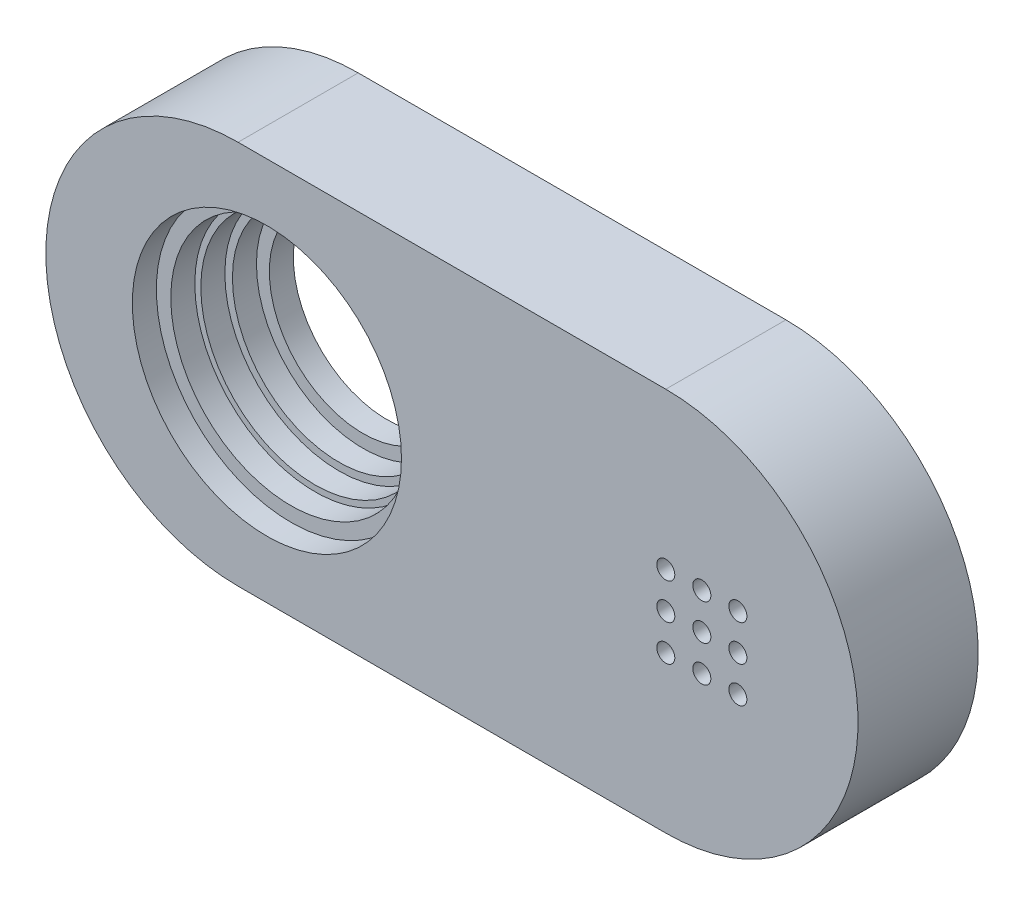
ISO-10303-21;
HEADER;
FILE_DESCRIPTION(('STEP AP214'),'2;1');
FILE_NAME('part.step','',(''),(''),'','','');
FILE_SCHEMA(('AUTOMOTIVE_DESIGN { 1 0 10303 214 1 1 1 1 }'));
ENDSEC;
DATA;
#1=APPLICATION_CONTEXT('core data for automotive mechanical design processes');
#2=APPLICATION_PROTOCOL_DEFINITION('international standard','automotive_design',2000,#1);
#3=PRODUCT_CONTEXT('',#1,'mechanical');
#4=PRODUCT('Part','Part','',(#3));
#5=PRODUCT_RELATED_PRODUCT_CATEGORY('part','',(#4));
#6=PRODUCT_DEFINITION_FORMATION('','',#4);
#7=PRODUCT_DEFINITION_CONTEXT('part definition',#1,'design');
#8=PRODUCT_DEFINITION('design','',#6,#7);
#9=PRODUCT_DEFINITION_SHAPE('','',#8);
#10=(LENGTH_UNIT() NAMED_UNIT(*) SI_UNIT(.MILLI.,.METRE.));
#11=(NAMED_UNIT(*) PLANE_ANGLE_UNIT() SI_UNIT($,.RADIAN.));
#12=(NAMED_UNIT(*) SI_UNIT($,.STERADIAN.) SOLID_ANGLE_UNIT());
#13=UNCERTAINTY_MEASURE_WITH_UNIT(LENGTH_MEASURE(1.E-05),#10,'distance_accuracy_value','');
#14=(GEOMETRIC_REPRESENTATION_CONTEXT(3) GLOBAL_UNCERTAINTY_ASSIGNED_CONTEXT((#13)) GLOBAL_UNIT_ASSIGNED_CONTEXT((#10,
#11,#12)) REPRESENTATION_CONTEXT('',''));
#15=CARTESIAN_POINT('',(0.,0.,0.));
#16=DIRECTION('',(0.,0.,1.));
#17=DIRECTION('',(1.,0.,0.));
#18=AXIS2_PLACEMENT_3D('',#15,#16,#17);
#19=CARTESIAN_POINT('',(-7.7,0.,3.));
#20=DIRECTION('',(0.,0.,1.));
#21=DIRECTION('',(1.,0.,0.));
#22=AXIS2_PLACEMENT_3D('',#19,#20,#21);
#23=PLANE('',#22);
#24=CARTESIAN_POINT('',(-7.7,0.,3.));
#25=DIRECTION('',(0.,0.,1.));
#26=DIRECTION('',(1.,0.,0.));
#27=AXIS2_PLACEMENT_3D('',#24,#25,#26);
#28=CIRCLE('',#27,4.75);
#29=CARTESIAN_POINT('',(-2.95,0.,3.));
#30=VERTEX_POINT('',#29);
#31=EDGE_CURVE('E20',#30,#30,#28,.F.);
#32=ORIENTED_EDGE('',*,*,#31,.T.);
#33=EDGE_LOOP('',(#32));
#34=FACE_BOUND('',#33,.T.);
#35=CARTESIAN_POINT('',(-7.7,0.,3.));
#36=DIRECTION('',(0.,0.,1.));
#37=DIRECTION('',(1.,0.,0.));
#38=AXIS2_PLACEMENT_3D('',#35,#36,#37);
#39=CIRCLE('',#38,5.);
#40=CARTESIAN_POINT('',(-2.7,0.,3.));
#41=VERTEX_POINT('',#40);
#42=EDGE_CURVE('E168',#41,#41,#39,.T.);
#43=ORIENTED_EDGE('',*,*,#42,.T.);
#44=EDGE_LOOP('',(#43));
#45=FACE_BOUND('',#44,.T.);
#46=ADVANCED_FACE('F17',(#34,#45),#23,.T.);
#47=CARTESIAN_POINT('',(-7.7,0.,2.));
#48=DIRECTION('',(0.,0.,1.));
#49=DIRECTION('',(1.,0.,0.));
#50=AXIS2_PLACEMENT_3D('',#47,#48,#49);
#51=CYLINDRICAL_SURFACE('',#50,4.75);
#52=ORIENTED_EDGE('',*,*,#31,.F.);
#53=EDGE_LOOP('',(#52));
#54=FACE_BOUND('',#53,.T.);
#55=CARTESIAN_POINT('',(-7.7,0.,2.));
#56=DIRECTION('',(0.,0.,1.));
#57=DIRECTION('',(1.,0.,0.));
#58=AXIS2_PLACEMENT_3D('',#55,#56,#57);
#59=CIRCLE('',#58,4.75);
#60=CARTESIAN_POINT('',(-2.95,0.,2.));
#61=VERTEX_POINT('',#60);
#62=EDGE_CURVE('E166',#61,#61,#59,.T.);
#63=ORIENTED_EDGE('',*,*,#62,.F.);
#64=EDGE_LOOP('',(#63));
#65=FACE_BOUND('',#64,.T.);
#66=ADVANCED_FACE('F176',(#54,#65),#51,.F.);
#67=CARTESIAN_POINT('',(-7.7,0.,3.));
#68=DIRECTION('',(0.,0.,1.));
#69=DIRECTION('',(1.,0.,0.));
#70=AXIS2_PLACEMENT_3D('',#67,#68,#69);
#71=CYLINDRICAL_SURFACE('',#70,5.);
#72=ORIENTED_EDGE('',*,*,#42,.F.);
#73=EDGE_LOOP('',(#72));
#74=FACE_BOUND('',#73,.T.);
#75=CARTESIAN_POINT('',(-7.7,0.,4.));
#76=DIRECTION('',(0.,0.,1.));
#77=DIRECTION('',(1.,0.,0.));
#78=AXIS2_PLACEMENT_3D('',#75,#76,#77);
#79=CIRCLE('',#78,5.);
#80=CARTESIAN_POINT('',(-2.7,0.,4.));
#81=VERTEX_POINT('',#80);
#82=EDGE_CURVE('E163',#81,#81,#79,.F.);
#83=ORIENTED_EDGE('',*,*,#82,.F.);
#84=EDGE_LOOP('',(#83));
#85=FACE_BOUND('',#84,.T.);
#86=ADVANCED_FACE('F179',(#74,#85),#71,.F.);
#87=CARTESIAN_POINT('',(-7.7,0.,2.));
#88=DIRECTION('',(0.,0.,1.));
#89=DIRECTION('',(1.,0.,0.));
#90=AXIS2_PLACEMENT_3D('',#87,#88,#89);
#91=PLANE('',#90);
#92=CARTESIAN_POINT('',(-7.7,0.,2.));
#93=DIRECTION('',(0.,0.,1.));
#94=DIRECTION('',(1.,0.,0.));
#95=AXIS2_PLACEMENT_3D('',#92,#93,#94);
#96=CIRCLE('',#95,4.435);
#97=CARTESIAN_POINT('',(-3.265,0.,2.));
#98=VERTEX_POINT('',#97);
#99=EDGE_CURVE('E160',#98,#98,#96,.F.);
#100=ORIENTED_EDGE('',*,*,#99,.T.);
#101=EDGE_LOOP('',(#100));
#102=FACE_BOUND('',#101,.T.);
#103=ORIENTED_EDGE('',*,*,#62,.T.);
#104=EDGE_LOOP('',(#103));
#105=FACE_BOUND('',#104,.T.);
#106=ADVANCED_FACE('F182',(#102,#105),#91,.T.);
#107=CARTESIAN_POINT('',(-7.7,0.,4.));
#108=DIRECTION('',(0.,0.,1.));
#109=DIRECTION('',(1.,0.,0.));
#110=AXIS2_PLACEMENT_3D('',#107,#108,#109);
#111=PLANE('',#110);
#112=ORIENTED_EDGE('',*,*,#82,.T.);
#113=EDGE_LOOP('',(#112));
#114=FACE_BOUND('',#113,.T.);
#115=CARTESIAN_POINT('',(-7.7,0.,4.));
#116=DIRECTION('',(0.,0.,1.));
#117=DIRECTION('',(1.,0.,0.));
#118=AXIS2_PLACEMENT_3D('',#115,#116,#117);
#119=CIRCLE('',#118,5.6);
#120=CARTESIAN_POINT('',(-2.1,0.,4.));
#121=VERTEX_POINT('',#120);
#122=EDGE_CURVE('E157',#121,#121,#119,.T.);
#123=ORIENTED_EDGE('',*,*,#122,.T.);
#124=EDGE_LOOP('',(#123));
#125=FACE_BOUND('',#124,.T.);
#126=ADVANCED_FACE('F184',(#114,#125),#111,.T.);
#127=CARTESIAN_POINT('',(-7.7,0.,1.));
#128=DIRECTION('',(0.,0.,1.));
#129=DIRECTION('',(1.,0.,0.));
#130=AXIS2_PLACEMENT_3D('',#127,#128,#129);
#131=CYLINDRICAL_SURFACE('',#130,4.435);
#132=ORIENTED_EDGE('',*,*,#99,.F.);
#133=EDGE_LOOP('',(#132));
#134=FACE_BOUND('',#133,.T.);
#135=CARTESIAN_POINT('',(-7.7,0.,1.));
#136=DIRECTION('',(0.,0.,1.));
#137=DIRECTION('',(1.,0.,0.));
#138=AXIS2_PLACEMENT_3D('',#135,#136,#137);
#139=CIRCLE('',#138,4.435);
#140=CARTESIAN_POINT('',(-3.265,0.,1.));
#141=VERTEX_POINT('',#140);
#142=EDGE_CURVE('E154',#141,#141,#139,.T.);
#143=ORIENTED_EDGE('',*,*,#142,.F.);
#144=EDGE_LOOP('',(#143));
#145=FACE_BOUND('',#144,.T.);
#146=ADVANCED_FACE('F192',(#134,#145),#131,.F.);
#147=CARTESIAN_POINT('',(-7.7,0.,4.));
#148=DIRECTION('',(0.,0.,1.));
#149=DIRECTION('',(1.,0.,0.));
#150=AXIS2_PLACEMENT_3D('',#147,#148,#149);
#151=CYLINDRICAL_SURFACE('',#150,5.6);
#152=CARTESIAN_POINT('',(-7.7,0.,5.));
#153=DIRECTION('',(0.,0.,1.));
#154=DIRECTION('',(1.,0.,0.));
#155=AXIS2_PLACEMENT_3D('',#152,#153,#154);
#156=CIRCLE('',#155,5.6);
#157=CARTESIAN_POINT('',(-2.1,0.,5.));
#158=VERTEX_POINT('',#157);
#159=EDGE_CURVE('E151',#158,#158,#156,.F.);
#160=ORIENTED_EDGE('',*,*,#159,.F.);
#161=EDGE_LOOP('',(#160));
#162=FACE_BOUND('',#161,.T.);
#163=ORIENTED_EDGE('',*,*,#122,.F.);
#164=EDGE_LOOP('',(#163));
#165=FACE_BOUND('',#164,.T.);
#166=ADVANCED_FACE('F260',(#162,#165),#151,.F.);
#167=CARTESIAN_POINT('',(-7.7,0.,1.));
#168=DIRECTION('',(0.,0.,1.));
#169=DIRECTION('',(1.,0.,0.));
#170=AXIS2_PLACEMENT_3D('',#167,#168,#169);
#171=PLANE('',#170);
#172=CARTESIAN_POINT('',(-7.7,0.,1.));
#173=DIRECTION('',(0.,0.,1.));
#174=DIRECTION('',(1.,0.,0.));
#175=AXIS2_PLACEMENT_3D('',#172,#173,#174);
#176=CIRCLE('',#175,3.9);
#177=CARTESIAN_POINT('',(-3.8,0.,1.));
#178=VERTEX_POINT('',#177);
#179=EDGE_CURVE('E80',#178,#178,#176,.F.);
#180=ORIENTED_EDGE('',*,*,#179,.T.);
#181=EDGE_LOOP('',(#180));
#182=FACE_BOUND('',#181,.T.);
#183=ORIENTED_EDGE('',*,*,#142,.T.);
#184=EDGE_LOOP('',(#183));
#185=FACE_BOUND('',#184,.T.);
#186=ADVANCED_FACE('F257',(#182,#185),#171,.T.);
#187=CARTESIAN_POINT('',(-8.9,0.,5.));
#188=DIRECTION('',(0.,0.,1.));
#189=DIRECTION('',(1.,0.,0.));
#190=AXIS2_PLACEMENT_3D('',#187,#188,#189);
#191=PLANE('',#190);
#192=CARTESIAN_POINT('',(8.9,0.,5.));
#193=DIRECTION('',(0.,0.,-1.));
#194=DIRECTION('',(-1.,0.,0.));
#195=AXIS2_PLACEMENT_3D('',#192,#193,#194);
#196=CIRCLE('',#195,8.);
#197=CARTESIAN_POINT('',(8.9,8.,5.));
#198=VERTEX_POINT('',#197);
#199=CARTESIAN_POINT('',(8.9,-8.,5.));
#200=VERTEX_POINT('',#199);
#201=EDGE_CURVE('E55',#198,#200,#196,.T.);
#202=ORIENTED_EDGE('',*,*,#201,.F.);
#203=DIRECTION('',(1.,0.,0.));
#204=VECTOR('',#203,1.);
#205=CARTESIAN_POINT('',(-8.9,8.,5.));
#206=LINE('',#205,#204);
#207=CARTESIAN_POINT('',(-8.9,8.,5.));
#208=VERTEX_POINT('',#207);
#209=EDGE_CURVE('E67',#198,#208,#206,.F.);
#210=ORIENTED_EDGE('',*,*,#209,.T.);
#211=CARTESIAN_POINT('',(-8.9,0.,5.));
#212=DIRECTION('',(0.,0.,-1.));
#213=DIRECTION('',(-1.,0.,0.));
#214=AXIS2_PLACEMENT_3D('',#211,#212,#213);
#215=CIRCLE('',#214,8.);
#216=CARTESIAN_POINT('',(-8.9,-8.,5.));
#217=VERTEX_POINT('',#216);
#218=EDGE_CURVE('E60',#217,#208,#215,.T.);
#219=ORIENTED_EDGE('',*,*,#218,.F.);
#220=DIRECTION('',(-1.,0.,0.));
#221=VECTOR('',#220,1.);
#222=CARTESIAN_POINT('',(-8.9,-8.,5.));
#223=LINE('',#222,#221);
#224=EDGE_CURVE('E64',#217,#200,#223,.F.);
#225=ORIENTED_EDGE('',*,*,#224,.T.);
#226=EDGE_LOOP('',(#202,#210,#219,#225));
#227=FACE_BOUND('',#226,.T.);
#228=ORIENTED_EDGE('',*,*,#159,.T.);
#229=EDGE_LOOP('',(#228));
#230=FACE_BOUND('',#229,.T.);
#231=CARTESIAN_POINT('',(10.4,0.,5.));
#232=DIRECTION('',(0.,0.,1.));
#233=DIRECTION('',(1.,0.,0.));
#234=AXIS2_PLACEMENT_3D('',#231,#232,#233);
#235=CIRCLE('',#234,0.375);
#236=CARTESIAN_POINT('',(10.775,0.,5.));
#237=VERTEX_POINT('',#236);
#238=EDGE_CURVE('E83',#237,#237,#235,.F.);
#239=ORIENTED_EDGE('',*,*,#238,.T.);
#240=EDGE_LOOP('',(#239));
#241=FACE_BOUND('',#240,.T.);
#242=CARTESIAN_POINT('',(8.9,0.,5.));
#243=DIRECTION('',(0.,0.,1.));
#244=DIRECTION('',(1.,0.,0.));
#245=AXIS2_PLACEMENT_3D('',#242,#243,#244);
#246=CIRCLE('',#245,0.375);
#247=CARTESIAN_POINT('',(9.275,0.,5.));
#248=VERTEX_POINT('',#247);
#249=EDGE_CURVE('E127',#248,#248,#246,.F.);
#250=ORIENTED_EDGE('',*,*,#249,.T.);
#251=EDGE_LOOP('',(#250));
#252=FACE_BOUND('',#251,.T.);
#253=CARTESIAN_POINT('',(11.9,0.,5.));
#254=DIRECTION('',(0.,0.,1.));
#255=DIRECTION('',(1.,0.,0.));
#256=AXIS2_PLACEMENT_3D('',#253,#254,#255);
#257=CIRCLE('',#256,0.375);
#258=CARTESIAN_POINT('',(12.275,0.,5.));
#259=VERTEX_POINT('',#258);
#260=EDGE_CURVE('E130',#259,#259,#257,.F.);
#261=ORIENTED_EDGE('',*,*,#260,.T.);
#262=EDGE_LOOP('',(#261));
#263=FACE_BOUND('',#262,.T.);
#264=CARTESIAN_POINT('',(8.9,-1.5,5.));
#265=DIRECTION('',(0.,0.,1.));
#266=DIRECTION('',(1.,0.,0.));
#267=AXIS2_PLACEMENT_3D('',#264,#265,#266);
#268=CIRCLE('',#267,0.375);
#269=CARTESIAN_POINT('',(9.275,-1.5,5.));
#270=VERTEX_POINT('',#269);
#271=EDGE_CURVE('E133',#270,#270,#268,.F.);
#272=ORIENTED_EDGE('',*,*,#271,.T.);
#273=EDGE_LOOP('',(#272));
#274=FACE_BOUND('',#273,.T.);
#275=CARTESIAN_POINT('',(10.4,-1.5,5.));
#276=DIRECTION('',(0.,0.,1.));
#277=DIRECTION('',(1.,0.,0.));
#278=AXIS2_PLACEMENT_3D('',#275,#276,#277);
#279=CIRCLE('',#278,0.375);
#280=CARTESIAN_POINT('',(10.775,-1.5,5.));
#281=VERTEX_POINT('',#280);
#282=EDGE_CURVE('E136',#281,#281,#279,.F.);
#283=ORIENTED_EDGE('',*,*,#282,.T.);
#284=EDGE_LOOP('',(#283));
#285=FACE_BOUND('',#284,.T.);
#286=CARTESIAN_POINT('',(11.9,-1.5,5.));
#287=DIRECTION('',(0.,0.,1.));
#288=DIRECTION('',(1.,0.,0.));
#289=AXIS2_PLACEMENT_3D('',#286,#287,#288);
#290=CIRCLE('',#289,0.375);
#291=CARTESIAN_POINT('',(12.275,-1.5,5.));
#292=VERTEX_POINT('',#291);
#293=EDGE_CURVE('E139',#292,#292,#290,.F.);
#294=ORIENTED_EDGE('',*,*,#293,.T.);
#295=EDGE_LOOP('',(#294));
#296=FACE_BOUND('',#295,.T.);
#297=CARTESIAN_POINT('',(8.9,1.5,5.));
#298=DIRECTION('',(0.,0.,1.));
#299=DIRECTION('',(1.,0.,0.));
#300=AXIS2_PLACEMENT_3D('',#297,#298,#299);
#301=CIRCLE('',#300,0.375);
#302=CARTESIAN_POINT('',(9.275,1.5,5.));
#303=VERTEX_POINT('',#302);
#304=EDGE_CURVE('E142',#303,#303,#301,.F.);
#305=ORIENTED_EDGE('',*,*,#304,.T.);
#306=EDGE_LOOP('',(#305));
#307=FACE_BOUND('',#306,.T.);
#308=CARTESIAN_POINT('',(10.4,1.5,5.));
#309=DIRECTION('',(0.,0.,1.));
#310=DIRECTION('',(1.,0.,0.));
#311=AXIS2_PLACEMENT_3D('',#308,#309,#310);
#312=CIRCLE('',#311,0.375);
#313=CARTESIAN_POINT('',(10.775,1.5,5.));
#314=VERTEX_POINT('',#313);
#315=EDGE_CURVE('E145',#314,#314,#312,.F.);
#316=ORIENTED_EDGE('',*,*,#315,.T.);
#317=EDGE_LOOP('',(#316));
#318=FACE_BOUND('',#317,.T.);
#319=CARTESIAN_POINT('',(11.9,1.5,5.));
#320=DIRECTION('',(0.,0.,1.));
#321=DIRECTION('',(1.,0.,0.));
#322=AXIS2_PLACEMENT_3D('',#319,#320,#321);
#323=CIRCLE('',#322,0.375);
#324=CARTESIAN_POINT('',(12.275,1.5,5.));
#325=VERTEX_POINT('',#324);
#326=EDGE_CURVE('E148',#325,#325,#323,.F.);
#327=ORIENTED_EDGE('',*,*,#326,.T.);
#328=EDGE_LOOP('',(#327));
#329=FACE_BOUND('',#328,.T.);
#330=ADVANCED_FACE('F62',(#227,#230,#241,#252,#263,#274,#285,#296,#307,#318,#329),#191,.T.);
#331=CARTESIAN_POINT('',(11.9,1.5,0.));
#332=DIRECTION('',(0.,0.,1.));
#333=DIRECTION('',(1.,0.,0.));
#334=AXIS2_PLACEMENT_3D('',#331,#332,#333);
#335=CYLINDRICAL_SURFACE('',#334,0.375);
#336=CARTESIAN_POINT('',(11.9,1.5,0.));
#337=DIRECTION('',(0.,0.,1.));
#338=DIRECTION('',(1.,0.,0.));
#339=AXIS2_PLACEMENT_3D('',#336,#337,#338);
#340=CIRCLE('',#339,0.375);
#341=CARTESIAN_POINT('',(12.275,1.5,0.));
#342=VERTEX_POINT('',#341);
#343=EDGE_CURVE('E121',#342,#342,#340,.F.);
#344=ORIENTED_EDGE('',*,*,#343,.T.);
#345=EDGE_LOOP('',(#344));
#346=FACE_BOUND('',#345,.T.);
#347=ORIENTED_EDGE('',*,*,#326,.F.);
#348=EDGE_LOOP('',(#347));
#349=FACE_BOUND('',#348,.T.);
#350=ADVANCED_FACE('F250',(#346,#349),#335,.F.);
#351=CARTESIAN_POINT('',(10.4,1.5,0.));
#352=DIRECTION('',(0.,0.,1.));
#353=DIRECTION('',(1.,0.,0.));
#354=AXIS2_PLACEMENT_3D('',#351,#352,#353);
#355=CYLINDRICAL_SURFACE('',#354,0.375);
#356=CARTESIAN_POINT('',(10.4,1.5,0.));
#357=DIRECTION('',(0.,0.,1.));
#358=DIRECTION('',(1.,0.,0.));
#359=AXIS2_PLACEMENT_3D('',#356,#357,#358);
#360=CIRCLE('',#359,0.375);
#361=CARTESIAN_POINT('',(10.775,1.5,0.));
#362=VERTEX_POINT('',#361);
#363=EDGE_CURVE('E118',#362,#362,#360,.F.);
#364=ORIENTED_EDGE('',*,*,#363,.T.);
#365=EDGE_LOOP('',(#364));
#366=FACE_BOUND('',#365,.T.);
#367=ORIENTED_EDGE('',*,*,#315,.F.);
#368=EDGE_LOOP('',(#367));
#369=FACE_BOUND('',#368,.T.);
#370=ADVANCED_FACE('F246',(#366,#369),#355,.F.);
#371=CARTESIAN_POINT('',(8.9,1.5,0.));
#372=DIRECTION('',(0.,0.,1.));
#373=DIRECTION('',(1.,0.,0.));
#374=AXIS2_PLACEMENT_3D('',#371,#372,#373);
#375=CYLINDRICAL_SURFACE('',#374,0.375);
#376=CARTESIAN_POINT('',(8.9,1.5,0.));
#377=DIRECTION('',(0.,0.,1.));
#378=DIRECTION('',(1.,0.,0.));
#379=AXIS2_PLACEMENT_3D('',#376,#377,#378);
#380=CIRCLE('',#379,0.375);
#381=CARTESIAN_POINT('',(9.275,1.5,0.));
#382=VERTEX_POINT('',#381);
#383=EDGE_CURVE('E115',#382,#382,#380,.F.);
#384=ORIENTED_EDGE('',*,*,#383,.T.);
#385=EDGE_LOOP('',(#384));
#386=FACE_BOUND('',#385,.T.);
#387=ORIENTED_EDGE('',*,*,#304,.F.);
#388=EDGE_LOOP('',(#387));
#389=FACE_BOUND('',#388,.T.);
#390=ADVANCED_FACE('F242',(#386,#389),#375,.F.);
#391=CARTESIAN_POINT('',(11.9,-1.5,0.));
#392=DIRECTION('',(0.,0.,1.));
#393=DIRECTION('',(1.,0.,0.));
#394=AXIS2_PLACEMENT_3D('',#391,#392,#393);
#395=CYLINDRICAL_SURFACE('',#394,0.375);
#396=CARTESIAN_POINT('',(11.9,-1.5,0.));
#397=DIRECTION('',(0.,0.,1.));
#398=DIRECTION('',(1.,0.,0.));
#399=AXIS2_PLACEMENT_3D('',#396,#397,#398);
#400=CIRCLE('',#399,0.375);
#401=CARTESIAN_POINT('',(12.275,-1.5,0.));
#402=VERTEX_POINT('',#401);
#403=EDGE_CURVE('E112',#402,#402,#400,.F.);
#404=ORIENTED_EDGE('',*,*,#403,.T.);
#405=EDGE_LOOP('',(#404));
#406=FACE_BOUND('',#405,.T.);
#407=ORIENTED_EDGE('',*,*,#293,.F.);
#408=EDGE_LOOP('',(#407));
#409=FACE_BOUND('',#408,.T.);
#410=ADVANCED_FACE('F238',(#406,#409),#395,.F.);
#411=CARTESIAN_POINT('',(10.4,-1.5,0.));
#412=DIRECTION('',(0.,0.,1.));
#413=DIRECTION('',(1.,0.,0.));
#414=AXIS2_PLACEMENT_3D('',#411,#412,#413);
#415=CYLINDRICAL_SURFACE('',#414,0.375);
#416=CARTESIAN_POINT('',(10.4,-1.5,0.));
#417=DIRECTION('',(0.,0.,1.));
#418=DIRECTION('',(1.,0.,0.));
#419=AXIS2_PLACEMENT_3D('',#416,#417,#418);
#420=CIRCLE('',#419,0.375);
#421=CARTESIAN_POINT('',(10.775,-1.5,0.));
#422=VERTEX_POINT('',#421);
#423=EDGE_CURVE('E109',#422,#422,#420,.F.);
#424=ORIENTED_EDGE('',*,*,#423,.T.);
#425=EDGE_LOOP('',(#424));
#426=FACE_BOUND('',#425,.T.);
#427=ORIENTED_EDGE('',*,*,#282,.F.);
#428=EDGE_LOOP('',(#427));
#429=FACE_BOUND('',#428,.T.);
#430=ADVANCED_FACE('F234',(#426,#429),#415,.F.);
#431=CARTESIAN_POINT('',(8.9,-1.5,0.));
#432=DIRECTION('',(0.,0.,1.));
#433=DIRECTION('',(1.,0.,0.));
#434=AXIS2_PLACEMENT_3D('',#431,#432,#433);
#435=CYLINDRICAL_SURFACE('',#434,0.375);
#436=CARTESIAN_POINT('',(8.9,-1.5,0.));
#437=DIRECTION('',(0.,0.,1.));
#438=DIRECTION('',(1.,0.,0.));
#439=AXIS2_PLACEMENT_3D('',#436,#437,#438);
#440=CIRCLE('',#439,0.375);
#441=CARTESIAN_POINT('',(9.275,-1.5,0.));
#442=VERTEX_POINT('',#441);
#443=EDGE_CURVE('E106',#442,#442,#440,.F.);
#444=ORIENTED_EDGE('',*,*,#443,.T.);
#445=EDGE_LOOP('',(#444));
#446=FACE_BOUND('',#445,.T.);
#447=ORIENTED_EDGE('',*,*,#271,.F.);
#448=EDGE_LOOP('',(#447));
#449=FACE_BOUND('',#448,.T.);
#450=ADVANCED_FACE('F230',(#446,#449),#435,.F.);
#451=CARTESIAN_POINT('',(11.9,0.,0.));
#452=DIRECTION('',(0.,0.,1.));
#453=DIRECTION('',(1.,0.,0.));
#454=AXIS2_PLACEMENT_3D('',#451,#452,#453);
#455=CYLINDRICAL_SURFACE('',#454,0.375);
#456=CARTESIAN_POINT('',(11.9,0.,0.));
#457=DIRECTION('',(0.,0.,1.));
#458=DIRECTION('',(1.,0.,0.));
#459=AXIS2_PLACEMENT_3D('',#456,#457,#458);
#460=CIRCLE('',#459,0.375);
#461=CARTESIAN_POINT('',(12.275,0.,0.));
#462=VERTEX_POINT('',#461);
#463=EDGE_CURVE('E103',#462,#462,#460,.F.);
#464=ORIENTED_EDGE('',*,*,#463,.T.);
#465=EDGE_LOOP('',(#464));
#466=FACE_BOUND('',#465,.T.);
#467=ORIENTED_EDGE('',*,*,#260,.F.);
#468=EDGE_LOOP('',(#467));
#469=FACE_BOUND('',#468,.T.);
#470=ADVANCED_FACE('F226',(#466,#469),#455,.F.);
#471=CARTESIAN_POINT('',(8.9,0.,0.));
#472=DIRECTION('',(0.,0.,1.));
#473=DIRECTION('',(1.,0.,0.));
#474=AXIS2_PLACEMENT_3D('',#471,#472,#473);
#475=CYLINDRICAL_SURFACE('',#474,0.375);
#476=CARTESIAN_POINT('',(8.9,0.,0.));
#477=DIRECTION('',(0.,0.,1.));
#478=DIRECTION('',(1.,0.,0.));
#479=AXIS2_PLACEMENT_3D('',#476,#477,#478);
#480=CIRCLE('',#479,0.375);
#481=CARTESIAN_POINT('',(9.275,0.,0.));
#482=VERTEX_POINT('',#481);
#483=EDGE_CURVE('E100',#482,#482,#480,.F.);
#484=ORIENTED_EDGE('',*,*,#483,.T.);
#485=EDGE_LOOP('',(#484));
#486=FACE_BOUND('',#485,.T.);
#487=ORIENTED_EDGE('',*,*,#249,.F.);
#488=EDGE_LOOP('',(#487));
#489=FACE_BOUND('',#488,.T.);
#490=ADVANCED_FACE('F222',(#486,#489),#475,.F.);
#491=CARTESIAN_POINT('',(10.4,0.,0.));
#492=DIRECTION('',(0.,0.,1.));
#493=DIRECTION('',(1.,0.,0.));
#494=AXIS2_PLACEMENT_3D('',#491,#492,#493);
#495=CYLINDRICAL_SURFACE('',#494,0.375);
#496=CARTESIAN_POINT('',(10.4,0.,0.));
#497=DIRECTION('',(0.,0.,1.));
#498=DIRECTION('',(1.,0.,0.));
#499=AXIS2_PLACEMENT_3D('',#496,#497,#498);
#500=CIRCLE('',#499,0.375);
#501=CARTESIAN_POINT('',(10.775,0.,0.));
#502=VERTEX_POINT('',#501);
#503=EDGE_CURVE('E97',#502,#502,#500,.F.);
#504=ORIENTED_EDGE('',*,*,#503,.T.);
#505=EDGE_LOOP('',(#504));
#506=FACE_BOUND('',#505,.T.);
#507=ORIENTED_EDGE('',*,*,#238,.F.);
#508=EDGE_LOOP('',(#507));
#509=FACE_BOUND('',#508,.T.);
#510=ADVANCED_FACE('F218',(#506,#509),#495,.F.);
#511=CARTESIAN_POINT('',(-7.7,0.,0.));
#512=DIRECTION('',(0.,0.,1.));
#513=DIRECTION('',(1.,0.,0.));
#514=AXIS2_PLACEMENT_3D('',#511,#512,#513);
#515=CYLINDRICAL_SURFACE('',#514,3.9);
#516=CARTESIAN_POINT('',(-7.7,0.,0.));
#517=DIRECTION('',(0.,0.,1.));
#518=DIRECTION('',(1.,0.,0.));
#519=AXIS2_PLACEMENT_3D('',#516,#517,#518);
#520=CIRCLE('',#519,3.9);
#521=CARTESIAN_POINT('',(-3.8,0.,0.));
#522=VERTEX_POINT('',#521);
#523=EDGE_CURVE('E94',#522,#522,#520,.F.);
#524=ORIENTED_EDGE('',*,*,#523,.T.);
#525=EDGE_LOOP('',(#524));
#526=FACE_BOUND('',#525,.T.);
#527=ORIENTED_EDGE('',*,*,#179,.F.);
#528=EDGE_LOOP('',(#527));
#529=FACE_BOUND('',#528,.T.);
#530=ADVANCED_FACE('F215',(#526,#529),#515,.F.);
#531=CARTESIAN_POINT('',(-8.9,-8.,5.));
#532=DIRECTION('',(0.,1.,0.));
#533=DIRECTION('',(-1.,0.,0.));
#534=AXIS2_PLACEMENT_3D('',#531,#532,#533);
#535=PLANE('',#534);
#536=DIRECTION('',(0.,0.,-1.));
#537=VECTOR('',#536,1.);
#538=CARTESIAN_POINT('',(8.9,-8.,5.));
#539=LINE('',#538,#537);
#540=CARTESIAN_POINT('',(8.9,-8.,0.));
#541=VERTEX_POINT('',#540);
#542=EDGE_CURVE('E77',#200,#541,#539,.T.);
#543=ORIENTED_EDGE('',*,*,#542,.F.);
#544=ORIENTED_EDGE('',*,*,#224,.F.);
#545=DIRECTION('',(0.,0.,1.));
#546=VECTOR('',#545,1.);
#547=CARTESIAN_POINT('',(-8.9,-8.,5.));
#548=LINE('',#547,#546);
#549=CARTESIAN_POINT('',(-8.9,-8.,0.));
#550=VERTEX_POINT('',#549);
#551=EDGE_CURVE('E76',#550,#217,#548,.T.);
#552=ORIENTED_EDGE('',*,*,#551,.F.);
#553=DIRECTION('',(1.,0.,0.));
#554=VECTOR('',#553,1.);
#555=CARTESIAN_POINT('',(-8.9,-8.,0.));
#556=LINE('',#555,#554);
#557=EDGE_CURVE('E92',#550,#541,#556,.T.);
#558=ORIENTED_EDGE('',*,*,#557,.T.);
#559=EDGE_LOOP('',(#543,#544,#552,#558));
#560=FACE_BOUND('',#559,.T.);
#561=ADVANCED_FACE('F74',(#560),#535,.F.);
#562=CARTESIAN_POINT('',(8.9,0.,5.));
#563=DIRECTION('',(0.,0.,-1.));
#564=DIRECTION('',(-1.,0.,0.));
#565=AXIS2_PLACEMENT_3D('',#562,#563,#564);
#566=CYLINDRICAL_SURFACE('',#565,8.);
#567=ORIENTED_EDGE('',*,*,#201,.T.);
#568=ORIENTED_EDGE('',*,*,#542,.T.);
#569=CARTESIAN_POINT('',(8.9,0.,0.));
#570=DIRECTION('',(0.,0.,-1.));
#571=DIRECTION('',(-1.,0.,0.));
#572=AXIS2_PLACEMENT_3D('',#569,#570,#571);
#573=CIRCLE('',#572,8.);
#574=CARTESIAN_POINT('',(8.9,8.,0.));
#575=VERTEX_POINT('',#574);
#576=EDGE_CURVE('E26',#541,#575,#573,.F.);
#577=ORIENTED_EDGE('',*,*,#576,.T.);
#578=DIRECTION('',(0.,0.,1.));
#579=VECTOR('',#578,1.);
#580=CARTESIAN_POINT('',(8.9,8.,5.));
#581=LINE('',#580,#579);
#582=EDGE_CURVE('E88',#575,#198,#581,.T.);
#583=ORIENTED_EDGE('',*,*,#582,.T.);
#584=EDGE_LOOP('',(#567,#568,#577,#583));
#585=FACE_BOUND('',#584,.T.);
#586=ADVANCED_FACE('F209',(#585),#566,.T.);
#587=CARTESIAN_POINT('',(-8.9,8.,5.));
#588=DIRECTION('',(0.,-1.,0.));
#589=DIRECTION('',(1.,0.,0.));
#590=AXIS2_PLACEMENT_3D('',#587,#588,#589);
#591=PLANE('',#590);
#592=DIRECTION('',(0.,0.,-1.));
#593=VECTOR('',#592,1.);
#594=CARTESIAN_POINT('',(-8.9,8.,5.));
#595=LINE('',#594,#593);
#596=CARTESIAN_POINT('',(-8.9,8.,0.));
#597=VERTEX_POINT('',#596);
#598=EDGE_CURVE('E71',#208,#597,#595,.T.);
#599=ORIENTED_EDGE('',*,*,#598,.F.);
#600=ORIENTED_EDGE('',*,*,#209,.F.);
#601=ORIENTED_EDGE('',*,*,#582,.F.);
#602=DIRECTION('',(1.,0.,0.));
#603=VECTOR('',#602,1.);
#604=CARTESIAN_POINT('',(-8.9,8.,0.));
#605=LINE('',#604,#603);
#606=EDGE_CURVE('E11',#575,#597,#605,.F.);
#607=ORIENTED_EDGE('',*,*,#606,.T.);
#608=EDGE_LOOP('',(#599,#600,#601,#607));
#609=FACE_BOUND('',#608,.T.);
#610=ADVANCED_FACE('F203',(#609),#591,.F.);
#611=CARTESIAN_POINT('',(-8.9,0.,5.));
#612=DIRECTION('',(0.,0.,-1.));
#613=DIRECTION('',(-1.,0.,0.));
#614=AXIS2_PLACEMENT_3D('',#611,#612,#613);
#615=CYLINDRICAL_SURFACE('',#614,8.);
#616=ORIENTED_EDGE('',*,*,#598,.T.);
#617=CARTESIAN_POINT('',(-8.9,0.,0.));
#618=DIRECTION('',(0.,0.,-1.));
#619=DIRECTION('',(-1.,0.,0.));
#620=AXIS2_PLACEMENT_3D('',#617,#618,#619);
#621=CIRCLE('',#620,8.);
#622=EDGE_CURVE('E35',#597,#550,#621,.F.);
#623=ORIENTED_EDGE('',*,*,#622,.T.);
#624=ORIENTED_EDGE('',*,*,#551,.T.);
#625=ORIENTED_EDGE('',*,*,#218,.T.);
#626=EDGE_LOOP('',(#616,#623,#624,#625));
#627=FACE_BOUND('',#626,.T.);
#628=ADVANCED_FACE('F79',(#627),#615,.T.);
#629=CARTESIAN_POINT('',(-8.9,0.,0.));
#630=DIRECTION('',(0.,0.,1.));
#631=DIRECTION('',(1.,0.,0.));
#632=AXIS2_PLACEMENT_3D('',#629,#630,#631);
#633=PLANE('',#632);
#634=ORIENTED_EDGE('',*,*,#606,.F.);
#635=ORIENTED_EDGE('',*,*,#576,.F.);
#636=ORIENTED_EDGE('',*,*,#557,.F.);
#637=ORIENTED_EDGE('',*,*,#622,.F.);
#638=EDGE_LOOP('',(#634,#635,#636,#637));
#639=FACE_BOUND('',#638,.T.);
#640=ORIENTED_EDGE('',*,*,#523,.F.);
#641=EDGE_LOOP('',(#640));
#642=FACE_BOUND('',#641,.T.);
#643=ORIENTED_EDGE('',*,*,#503,.F.);
#644=EDGE_LOOP('',(#643));
#645=FACE_BOUND('',#644,.T.);
#646=ORIENTED_EDGE('',*,*,#483,.F.);
#647=EDGE_LOOP('',(#646));
#648=FACE_BOUND('',#647,.T.);
#649=ORIENTED_EDGE('',*,*,#463,.F.);
#650=EDGE_LOOP('',(#649));
#651=FACE_BOUND('',#650,.T.);
#652=ORIENTED_EDGE('',*,*,#443,.F.);
#653=EDGE_LOOP('',(#652));
#654=FACE_BOUND('',#653,.T.);
#655=ORIENTED_EDGE('',*,*,#423,.F.);
#656=EDGE_LOOP('',(#655));
#657=FACE_BOUND('',#656,.T.);
#658=ORIENTED_EDGE('',*,*,#403,.F.);
#659=EDGE_LOOP('',(#658));
#660=FACE_BOUND('',#659,.T.);
#661=ORIENTED_EDGE('',*,*,#383,.F.);
#662=EDGE_LOOP('',(#661));
#663=FACE_BOUND('',#662,.T.);
#664=ORIENTED_EDGE('',*,*,#363,.F.);
#665=EDGE_LOOP('',(#664));
#666=FACE_BOUND('',#665,.T.);
#667=ORIENTED_EDGE('',*,*,#343,.F.);
#668=EDGE_LOOP('',(#667));
#669=FACE_BOUND('',#668,.T.);
#670=ADVANCED_FACE('F197',(#639,#642,#645,#648,#651,#654,#657,#660,#663,#666,#669),#633,.F.);
#671=CLOSED_SHELL('',(#46,#66,#86,#106,#126,#146,#166,#186,#330,#350,#370,#390,#410,#430,#450,
#470,#490,#510,#530,#561,#586,#610,#628,#670));
#672=MANIFOLD_SOLID_BREP('B1',#671);
#673=ADVANCED_BREP_SHAPE_REPRESENTATION('',(#18,#672),#14);
#674=SHAPE_DEFINITION_REPRESENTATION(#9,#673);
ENDSEC;
END-ISO-10303-21;
